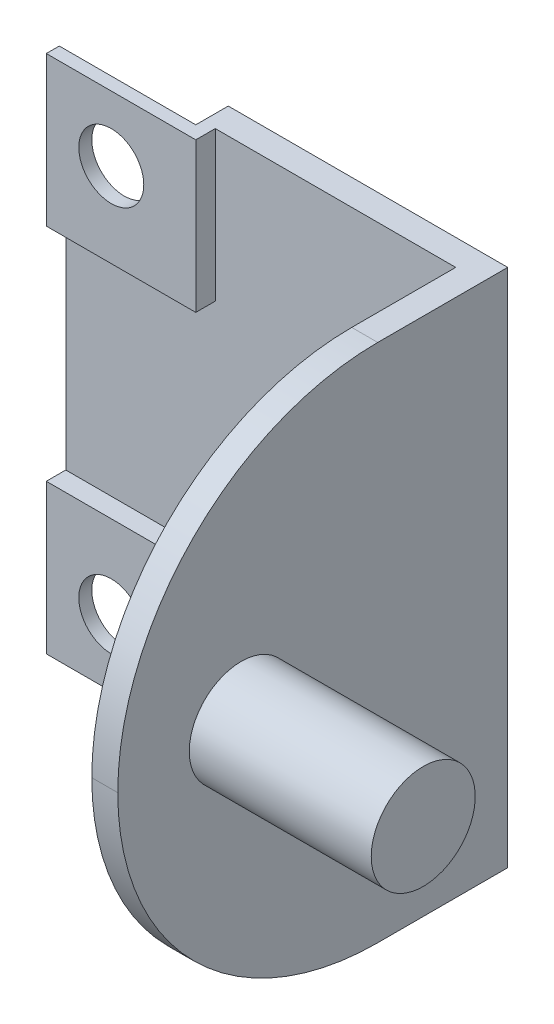
ISO-10303-21;
HEADER;
FILE_DESCRIPTION(('STEP AP214'),'2;1');
FILE_NAME('part.step','',(''),(''),'','','');
FILE_SCHEMA(('AUTOMOTIVE_DESIGN { 1 0 10303 214 1 1 1 1 }'));
ENDSEC;
DATA;
#1=APPLICATION_CONTEXT('core data for automotive mechanical design processes');
#2=APPLICATION_PROTOCOL_DEFINITION('international standard','automotive_design',2000,#1);
#3=PRODUCT_CONTEXT('',#1,'mechanical');
#4=PRODUCT('Part','Part','',(#3));
#5=PRODUCT_RELATED_PRODUCT_CATEGORY('part','',(#4));
#6=PRODUCT_DEFINITION_FORMATION('','',#4);
#7=PRODUCT_DEFINITION_CONTEXT('part definition',#1,'design');
#8=PRODUCT_DEFINITION('design','',#6,#7);
#9=PRODUCT_DEFINITION_SHAPE('','',#8);
#10=(LENGTH_UNIT() NAMED_UNIT(*) SI_UNIT(.MILLI.,.METRE.));
#11=(NAMED_UNIT(*) PLANE_ANGLE_UNIT() SI_UNIT($,.RADIAN.));
#12=(NAMED_UNIT(*) SI_UNIT($,.STERADIAN.) SOLID_ANGLE_UNIT());
#13=UNCERTAINTY_MEASURE_WITH_UNIT(LENGTH_MEASURE(1.E-05),#10,'distance_accuracy_value','');
#14=(GEOMETRIC_REPRESENTATION_CONTEXT(3) GLOBAL_UNCERTAINTY_ASSIGNED_CONTEXT((#13)) GLOBAL_UNIT_ASSIGNED_CONTEXT((#10,
#11,#12)) REPRESENTATION_CONTEXT('',''));
#15=CARTESIAN_POINT('',(0.,0.,0.));
#16=DIRECTION('',(0.,0.,1.));
#17=DIRECTION('',(1.,0.,0.));
#18=AXIS2_PLACEMENT_3D('',#15,#16,#17);
#19=CARTESIAN_POINT('',(-32.,10.5,-28.));
#20=DIRECTION('',(0.,1.,0.));
#21=DIRECTION('',(-1.,0.,0.));
#22=AXIS2_PLACEMENT_3D('',#19,#20,#21);
#23=PLANE('',#22);
#24=DIRECTION('',(1.,0.,0.));
#25=VECTOR('',#24,1.);
#26=CARTESIAN_POINT('',(-32.,10.5,2.5));
#27=LINE('',#26,#25);
#28=CARTESIAN_POINT('',(-32.,10.5,2.5));
#29=VERTEX_POINT('',#28);
#30=CARTESIAN_POINT('',(-21.5,10.5,2.5));
#31=VERTEX_POINT('',#30);
#32=EDGE_CURVE('E179',#29,#31,#27,.T.);
#33=ORIENTED_EDGE('',*,*,#32,.F.);
#34=DIRECTION('',(0.,0.,1.));
#35=VECTOR('',#34,1.);
#36=CARTESIAN_POINT('',(-32.,10.5,-28.));
#37=LINE('',#36,#35);
#38=CARTESIAN_POINT('',(-32.,10.5,0.));
#39=VERTEX_POINT('',#38);
#40=EDGE_CURVE('E191',#39,#29,#37,.T.);
#41=ORIENTED_EDGE('',*,*,#40,.F.);
#42=DIRECTION('',(-1.,0.,0.));
#43=VECTOR('',#42,1.);
#44=CARTESIAN_POINT('',(0.,10.5,0.));
#45=LINE('',#44,#43);
#46=CARTESIAN_POINT('',(-21.5,10.5,0.));
#47=VERTEX_POINT('',#46);
#48=EDGE_CURVE('E291',#47,#39,#45,.T.);
#49=ORIENTED_EDGE('',*,*,#48,.F.);
#50=DIRECTION('',(0.,0.,1.));
#51=VECTOR('',#50,1.);
#52=CARTESIAN_POINT('',(-21.5,10.5,-28.));
#53=LINE('',#52,#51);
#54=EDGE_CURVE('E67',#47,#31,#53,.T.);
#55=ORIENTED_EDGE('',*,*,#54,.T.);
#56=EDGE_LOOP('',(#33,#41,#49,#55));
#57=FACE_BOUND('',#56,.T.);
#58=ADVANCED_FACE('F41',(#57),#23,.F.);
#59=CARTESIAN_POINT('',(-21.5,0.,-28.));
#60=DIRECTION('',(1.,0.,0.));
#61=DIRECTION('',(0.,1.,0.));
#62=AXIS2_PLACEMENT_3D('',#59,#60,#61);
#63=PLANE('',#62);
#64=DIRECTION('',(0.,-1.,0.));
#65=VECTOR('',#64,1.);
#66=CARTESIAN_POINT('',(-21.5,0.,2.50000000000001));
#67=LINE('',#66,#65);
#68=CARTESIAN_POINT('',(-21.5,0.,2.50000000000001));
#69=VERTEX_POINT('',#68);
#70=EDGE_CURVE('E188',#31,#69,#67,.T.);
#71=ORIENTED_EDGE('',*,*,#70,.F.);
#72=ORIENTED_EDGE('',*,*,#54,.F.);
#73=DIRECTION('',(0.,1.,0.));
#74=VECTOR('',#73,1.);
#75=CARTESIAN_POINT('',(-21.5,0.,0.));
#76=LINE('',#75,#74);
#77=CARTESIAN_POINT('',(-21.5,0.,0.));
#78=VERTEX_POINT('',#77);
#79=EDGE_CURVE('E284',#78,#47,#76,.T.);
#80=ORIENTED_EDGE('',*,*,#79,.F.);
#81=DIRECTION('',(0.,0.,1.));
#82=VECTOR('',#81,1.);
#83=CARTESIAN_POINT('',(-21.5,0.,-28.));
#84=LINE('',#83,#82);
#85=EDGE_CURVE('E209',#78,#69,#84,.T.);
#86=ORIENTED_EDGE('',*,*,#85,.T.);
#87=EDGE_LOOP('',(#71,#72,#80,#86));
#88=FACE_BOUND('',#87,.T.);
#89=ADVANCED_FACE('F476',(#88),#63,.F.);
#90=CARTESIAN_POINT('',(-21.5,40.,-28.));
#91=DIRECTION('',(1.,0.,0.));
#92=DIRECTION('',(0.,0.,-1.));
#93=AXIS2_PLACEMENT_3D('',#90,#91,#92);
#94=PLANE('',#93);
#95=DIRECTION('',(0.,-1.,0.));
#96=VECTOR('',#95,1.);
#97=CARTESIAN_POINT('',(-21.5,40.,2.5));
#98=LINE('',#97,#96);
#99=CARTESIAN_POINT('',(-21.5,40.,2.5));
#100=VERTEX_POINT('',#99);
#101=CARTESIAN_POINT('',(-21.5,29.5,2.5));
#102=VERTEX_POINT('',#101);
#103=EDGE_CURVE('E194',#100,#102,#98,.T.);
#104=ORIENTED_EDGE('',*,*,#103,.F.);
#105=DIRECTION('',(0.,0.,1.));
#106=VECTOR('',#105,1.);
#107=CARTESIAN_POINT('',(-21.5,40.,-28.));
#108=LINE('',#107,#106);
#109=CARTESIAN_POINT('',(-21.5,40.,0.));
#110=VERTEX_POINT('',#109);
#111=EDGE_CURVE('E222',#110,#100,#108,.T.);
#112=ORIENTED_EDGE('',*,*,#111,.F.);
#113=DIRECTION('',(0.,1.,0.));
#114=VECTOR('',#113,1.);
#115=CARTESIAN_POINT('',(-21.5,0.,0.));
#116=LINE('',#115,#114);
#117=CARTESIAN_POINT('',(-21.5,29.5,0.));
#118=VERTEX_POINT('',#117);
#119=EDGE_CURVE('E11',#118,#110,#116,.T.);
#120=ORIENTED_EDGE('',*,*,#119,.F.);
#121=DIRECTION('',(0.,0.,1.));
#122=VECTOR('',#121,1.);
#123=CARTESIAN_POINT('',(-21.5,29.5,-28.));
#124=LINE('',#123,#122);
#125=EDGE_CURVE('E59',#118,#102,#124,.T.);
#126=ORIENTED_EDGE('',*,*,#125,.T.);
#127=EDGE_LOOP('',(#104,#112,#120,#126));
#128=FACE_BOUND('',#127,.T.);
#129=ADVANCED_FACE('F401',(#128),#94,.F.);
#130=CARTESIAN_POINT('',(-32.,29.5,-28.));
#131=DIRECTION('',(0.,-1.,0.));
#132=DIRECTION('',(0.,0.,-1.));
#133=AXIS2_PLACEMENT_3D('',#130,#131,#132);
#134=PLANE('',#133);
#135=DIRECTION('',(1.,0.,0.));
#136=VECTOR('',#135,1.);
#137=CARTESIAN_POINT('',(-32.,29.5,2.5));
#138=LINE('',#137,#136);
#139=CARTESIAN_POINT('',(-32.,29.5,2.5));
#140=VERTEX_POINT('',#139);
#141=EDGE_CURVE('E328',#140,#102,#138,.T.);
#142=ORIENTED_EDGE('',*,*,#141,.T.);
#143=ORIENTED_EDGE('',*,*,#125,.F.);
#144=DIRECTION('',(1.,0.,0.));
#145=VECTOR('',#144,1.);
#146=CARTESIAN_POINT('',(0.,29.5,0.));
#147=LINE('',#146,#145);
#148=CARTESIAN_POINT('',(-32.,29.5,0.));
#149=VERTEX_POINT('',#148);
#150=EDGE_CURVE('E51',#149,#118,#147,.T.);
#151=ORIENTED_EDGE('',*,*,#150,.F.);
#152=DIRECTION('',(0.,0.,1.));
#153=VECTOR('',#152,1.);
#154=CARTESIAN_POINT('',(-32.,29.5,-28.));
#155=LINE('',#154,#153);
#156=EDGE_CURVE('E203',#149,#140,#155,.T.);
#157=ORIENTED_EDGE('',*,*,#156,.T.);
#158=EDGE_LOOP('',(#142,#143,#151,#157));
#159=FACE_BOUND('',#158,.T.);
#160=ADVANCED_FACE('F405',(#159),#134,.F.);
#161=CARTESIAN_POINT('',(0.,0.,2.));
#162=DIRECTION('',(-1.,0.,0.));
#163=DIRECTION('',(0.,-1.,0.));
#164=AXIS2_PLACEMENT_3D('',#161,#162,#163);
#165=PLANE('',#164);
#166=CARTESIAN_POINT('',(0.,20.,20.5));
#167=DIRECTION('',(1.,0.,0.));
#168=DIRECTION('',(0.,1.,0.));
#169=AXIS2_PLACEMENT_3D('',#166,#167,#168);
#170=CIRCLE('',#169,4.);
#171=CARTESIAN_POINT('',(0.,24.,20.5));
#172=VERTEX_POINT('',#171);
#173=EDGE_CURVE('E217',#172,#172,#170,.T.);
#174=ORIENTED_EDGE('',*,*,#173,.F.);
#175=EDGE_LOOP('',(#174));
#176=FACE_BOUND('',#175,.T.);
#177=DIRECTION('',(0.,0.,-1.));
#178=VECTOR('',#177,1.);
#179=CARTESIAN_POINT('',(0.,40.,2.));
#180=LINE('',#179,#178);
#181=CARTESIAN_POINT('',(0.,40.,10.));
#182=VERTEX_POINT('',#181);
#183=CARTESIAN_POINT('',(0.,40.,0.));
#184=VERTEX_POINT('',#183);
#185=EDGE_CURVE('E262',#182,#184,#180,.T.);
#186=ORIENTED_EDGE('',*,*,#185,.F.);
#187=CARTESIAN_POINT('',(0.,20.,10.));
#188=DIRECTION('',(-1.,0.,0.));
#189=DIRECTION('',(0.,-1.,0.));
#190=AXIS2_PLACEMENT_3D('',#187,#188,#189);
#191=CIRCLE('',#190,20.);
#192=CARTESIAN_POINT('',(0.,20.,30.));
#193=VERTEX_POINT('',#192);
#194=EDGE_CURVE('E278',#182,#193,#191,.F.);
#195=ORIENTED_EDGE('',*,*,#194,.T.);
#196=CARTESIAN_POINT('',(0.,20.,10.));
#197=DIRECTION('',(-1.,0.,0.));
#198=DIRECTION('',(0.,-1.,0.));
#199=AXIS2_PLACEMENT_3D('',#196,#197,#198);
#200=CIRCLE('',#199,20.);
#201=CARTESIAN_POINT('',(0.,0.,10.));
#202=VERTEX_POINT('',#201);
#203=EDGE_CURVE('E275',#193,#202,#200,.F.);
#204=ORIENTED_EDGE('',*,*,#203,.T.);
#205=DIRECTION('',(0.,0.,-1.));
#206=VECTOR('',#205,1.);
#207=CARTESIAN_POINT('',(0.,0.,2.));
#208=LINE('',#207,#206);
#209=CARTESIAN_POINT('',(0.,0.,0.));
#210=VERTEX_POINT('',#209);
#211=EDGE_CURVE('E247',#202,#210,#208,.T.);
#212=ORIENTED_EDGE('',*,*,#211,.T.);
#213=DIRECTION('',(0.,1.,0.));
#214=VECTOR('',#213,1.);
#215=CARTESIAN_POINT('',(0.,0.,0.));
#216=LINE('',#215,#214);
#217=EDGE_CURVE('E234',#210,#184,#216,.T.);
#218=ORIENTED_EDGE('',*,*,#217,.T.);
#219=EDGE_LOOP('',(#186,#195,#204,#212,#218));
#220=FACE_BOUND('',#219,.T.);
#221=ADVANCED_FACE('F419',(#176,#220),#165,.F.);
#222=CARTESIAN_POINT('',(0.,40.,2.));
#223=DIRECTION('',(0.,-1.,0.));
#224=DIRECTION('',(1.,0.,0.));
#225=AXIS2_PLACEMENT_3D('',#222,#223,#224);
#226=PLANE('',#225);
#227=DIRECTION('',(-1.,0.,0.));
#228=VECTOR('',#227,1.);
#229=CARTESIAN_POINT('',(0.,40.,0.));
#230=LINE('',#229,#228);
#231=EDGE_CURVE('E251',#184,#110,#230,.T.);
#232=ORIENTED_EDGE('',*,*,#231,.T.);
#233=ORIENTED_EDGE('',*,*,#111,.T.);
#234=DIRECTION('',(1.,0.,0.));
#235=VECTOR('',#234,1.);
#236=CARTESIAN_POINT('',(-32.,40.,2.5));
#237=LINE('',#236,#235);
#238=CARTESIAN_POINT('',(-32.,40.,2.5));
#239=VERTEX_POINT('',#238);
#240=EDGE_CURVE('E333',#239,#100,#237,.T.);
#241=ORIENTED_EDGE('',*,*,#240,.F.);
#242=DIRECTION('',(0.,0.,-1.));
#243=VECTOR('',#242,1.);
#244=CARTESIAN_POINT('',(-32.,40.,3.5));
#245=LINE('',#244,#243);
#246=CARTESIAN_POINT('',(-32.,40.,3.5));
#247=VERTEX_POINT('',#246);
#248=EDGE_CURVE('E322',#247,#239,#245,.T.);
#249=ORIENTED_EDGE('',*,*,#248,.F.);
#250=DIRECTION('',(-1.,0.,0.));
#251=VECTOR('',#250,1.);
#252=CARTESIAN_POINT('',(0.,40.,3.5));
#253=LINE('',#252,#251);
#254=CARTESIAN_POINT('',(-20.5,40.,3.5));
#255=VERTEX_POINT('',#254);
#256=EDGE_CURVE('E371',#255,#247,#253,.T.);
#257=ORIENTED_EDGE('',*,*,#256,.F.);
#258=DIRECTION('',(0.,0.,-1.));
#259=VECTOR('',#258,1.);
#260=CARTESIAN_POINT('',(-20.5,40.,3.5));
#261=LINE('',#260,#259);
#262=CARTESIAN_POINT('',(-20.5,40.,2.));
#263=VERTEX_POINT('',#262);
#264=EDGE_CURVE('E216',#255,#263,#261,.T.);
#265=ORIENTED_EDGE('',*,*,#264,.T.);
#266=DIRECTION('',(-1.,0.,0.));
#267=VECTOR('',#266,1.);
#268=CARTESIAN_POINT('',(0.,40.,2.));
#269=LINE('',#268,#267);
#270=CARTESIAN_POINT('',(-2.,40.,2.));
#271=VERTEX_POINT('',#270);
#272=EDGE_CURVE('E235',#271,#263,#269,.T.);
#273=ORIENTED_EDGE('',*,*,#272,.F.);
#274=DIRECTION('',(0.,0.,-1.));
#275=VECTOR('',#274,1.);
#276=CARTESIAN_POINT('',(-2.,40.,30.));
#277=LINE('',#276,#275);
#278=CARTESIAN_POINT('',(-2.,40.,10.));
#279=VERTEX_POINT('',#278);
#280=EDGE_CURVE('E231',#279,#271,#277,.T.);
#281=ORIENTED_EDGE('',*,*,#280,.F.);
#282=DIRECTION('',(-1.,0.,0.));
#283=VECTOR('',#282,1.);
#284=CARTESIAN_POINT('',(0.,40.,10.));
#285=LINE('',#284,#283);
#286=EDGE_CURVE('E271',#279,#182,#285,.F.);
#287=ORIENTED_EDGE('',*,*,#286,.T.);
#288=ORIENTED_EDGE('',*,*,#185,.T.);
#289=EDGE_LOOP('',(#232,#233,#241,#249,#257,#265,#273,#281,#287,#288));
#290=FACE_BOUND('',#289,.T.);
#291=ADVANCED_FACE('F413',(#290),#226,.F.);
#292=CARTESIAN_POINT('',(-32.,0.,2.));
#293=DIRECTION('',(1.,0.,0.));
#294=DIRECTION('',(0.,0.,-1.));
#295=AXIS2_PLACEMENT_3D('',#292,#293,#294);
#296=PLANE('',#295);
#297=DIRECTION('',(0.,-1.,0.));
#298=VECTOR('',#297,1.);
#299=CARTESIAN_POINT('',(-32.,0.,2.));
#300=LINE('',#299,#298);
#301=CARTESIAN_POINT('',(-32.,28.5,2.));
#302=VERTEX_POINT('',#301);
#303=CARTESIAN_POINT('',(-32.,11.5,2.));
#304=VERTEX_POINT('',#303);
#305=EDGE_CURVE('E239',#302,#304,#300,.T.);
#306=ORIENTED_EDGE('',*,*,#305,.F.);
#307=DIRECTION('',(0.,0.,-1.));
#308=VECTOR('',#307,1.);
#309=CARTESIAN_POINT('',(-32.,28.5,3.5));
#310=LINE('',#309,#308);
#311=CARTESIAN_POINT('',(-32.,28.5,3.5));
#312=VERTEX_POINT('',#311);
#313=EDGE_CURVE('E391',#312,#302,#310,.T.);
#314=ORIENTED_EDGE('',*,*,#313,.F.);
#315=DIRECTION('',(0.,-1.,0.));
#316=VECTOR('',#315,1.);
#317=CARTESIAN_POINT('',(-32.,0.,3.5));
#318=LINE('',#317,#316);
#319=EDGE_CURVE('E376',#247,#312,#318,.T.);
#320=ORIENTED_EDGE('',*,*,#319,.F.);
#321=ORIENTED_EDGE('',*,*,#248,.T.);
#322=DIRECTION('',(0.,-1.,0.));
#323=VECTOR('',#322,1.);
#324=CARTESIAN_POINT('',(-32.,40.,2.5));
#325=LINE('',#324,#323);
#326=EDGE_CURVE('E325',#239,#140,#325,.T.);
#327=ORIENTED_EDGE('',*,*,#326,.T.);
#328=ORIENTED_EDGE('',*,*,#156,.F.);
#329=DIRECTION('',(0.,-1.,0.));
#330=VECTOR('',#329,1.);
#331=CARTESIAN_POINT('',(-32.,0.,0.));
#332=LINE('',#331,#330);
#333=EDGE_CURVE('E201',#149,#39,#332,.T.);
#334=ORIENTED_EDGE('',*,*,#333,.T.);
#335=ORIENTED_EDGE('',*,*,#40,.T.);
#336=DIRECTION('',(0.,-1.,0.));
#337=VECTOR('',#336,1.);
#338=CARTESIAN_POINT('',(-32.,0.,2.50000000000001));
#339=LINE('',#338,#337);
#340=CARTESIAN_POINT('',(-32.,0.,2.50000000000001));
#341=VERTEX_POINT('',#340);
#342=EDGE_CURVE('E176',#29,#341,#339,.T.);
#343=ORIENTED_EDGE('',*,*,#342,.T.);
#344=DIRECTION('',(0.,0.,1.));
#345=VECTOR('',#344,1.);
#346=CARTESIAN_POINT('',(-32.,0.,3.50000000000001));
#347=LINE('',#346,#345);
#348=CARTESIAN_POINT('',(-32.,0.,3.50000000000001));
#349=VERTEX_POINT('',#348);
#350=EDGE_CURVE('E187',#341,#349,#347,.T.);
#351=ORIENTED_EDGE('',*,*,#350,.T.);
#352=DIRECTION('',(0.,-1.,0.));
#353=VECTOR('',#352,1.);
#354=CARTESIAN_POINT('',(-32.,0.,3.5));
#355=LINE('',#354,#353);
#356=CARTESIAN_POINT('',(-32.,11.5,3.5));
#357=VERTEX_POINT('',#356);
#358=EDGE_CURVE('E341',#357,#349,#355,.T.);
#359=ORIENTED_EDGE('',*,*,#358,.F.);
#360=DIRECTION('',(0.,0.,-1.));
#361=VECTOR('',#360,1.);
#362=CARTESIAN_POINT('',(-32.,11.5,3.5));
#363=LINE('',#362,#361);
#364=EDGE_CURVE('E363',#357,#304,#363,.T.);
#365=ORIENTED_EDGE('',*,*,#364,.T.);
#366=EDGE_LOOP('',(#306,#314,#320,#321,#327,#328,#334,#335,#343,#351,#359,#365));
#367=FACE_BOUND('',#366,.T.);
#368=ADVANCED_FACE('F198',(#367),#296,.F.);
#369=CARTESIAN_POINT('',(0.,0.,2.));
#370=DIRECTION('',(0.,1.,0.));
#371=DIRECTION('',(-1.,0.,0.));
#372=AXIS2_PLACEMENT_3D('',#369,#370,#371);
#373=PLANE('',#372);
#374=DIRECTION('',(1.,0.,0.));
#375=VECTOR('',#374,1.);
#376=CARTESIAN_POINT('',(0.,0.,2.));
#377=LINE('',#376,#375);
#378=CARTESIAN_POINT('',(-20.5,0.,2.));
#379=VERTEX_POINT('',#378);
#380=CARTESIAN_POINT('',(-2.,0.,2.));
#381=VERTEX_POINT('',#380);
#382=EDGE_CURVE('E244',#379,#381,#377,.T.);
#383=ORIENTED_EDGE('',*,*,#382,.F.);
#384=DIRECTION('',(0.,0.,-1.));
#385=VECTOR('',#384,1.);
#386=CARTESIAN_POINT('',(-20.5,0.,3.5));
#387=LINE('',#386,#385);
#388=CARTESIAN_POINT('',(-20.5,0.,3.5));
#389=VERTEX_POINT('',#388);
#390=EDGE_CURVE('E360',#389,#379,#387,.T.);
#391=ORIENTED_EDGE('',*,*,#390,.F.);
#392=DIRECTION('',(1.,0.,0.));
#393=VECTOR('',#392,1.);
#394=CARTESIAN_POINT('',(0.,0.,3.5));
#395=LINE('',#394,#393);
#396=EDGE_CURVE('E345',#349,#389,#395,.T.);
#397=ORIENTED_EDGE('',*,*,#396,.F.);
#398=ORIENTED_EDGE('',*,*,#350,.F.);
#399=DIRECTION('',(1.,0.,0.));
#400=VECTOR('',#399,1.);
#401=CARTESIAN_POINT('',(-32.,0.,2.50000000000001));
#402=LINE('',#401,#400);
#403=EDGE_CURVE('E181',#341,#69,#402,.T.);
#404=ORIENTED_EDGE('',*,*,#403,.T.);
#405=ORIENTED_EDGE('',*,*,#85,.F.);
#406=DIRECTION('',(1.,0.,0.));
#407=VECTOR('',#406,1.);
#408=CARTESIAN_POINT('',(0.,0.,0.));
#409=LINE('',#408,#407);
#410=EDGE_CURVE('E240',#78,#210,#409,.T.);
#411=ORIENTED_EDGE('',*,*,#410,.T.);
#412=ORIENTED_EDGE('',*,*,#211,.F.);
#413=DIRECTION('',(1.,0.,0.));
#414=VECTOR('',#413,1.);
#415=CARTESIAN_POINT('',(-2.,0.,10.));
#416=LINE('',#415,#414);
#417=CARTESIAN_POINT('',(-2.,0.,10.));
#418=VERTEX_POINT('',#417);
#419=EDGE_CURVE('E281',#202,#418,#416,.F.);
#420=ORIENTED_EDGE('',*,*,#419,.T.);
#421=DIRECTION('',(0.,0.,-1.));
#422=VECTOR('',#421,1.);
#423=CARTESIAN_POINT('',(-2.,0.,30.));
#424=LINE('',#423,#422);
#425=EDGE_CURVE('E227',#418,#381,#424,.T.);
#426=ORIENTED_EDGE('',*,*,#425,.T.);
#427=EDGE_LOOP('',(#383,#391,#397,#398,#404,#405,#411,#412,#420,#426));
#428=FACE_BOUND('',#427,.T.);
#429=ADVANCED_FACE('F425',(#428),#373,.F.);
#430=CARTESIAN_POINT('',(0.,0.,2.));
#431=DIRECTION('',(0.,0.,1.));
#432=DIRECTION('',(1.,0.,0.));
#433=AXIS2_PLACEMENT_3D('',#430,#431,#432);
#434=PLANE('',#433);
#435=DIRECTION('',(1.,0.,0.));
#436=VECTOR('',#435,1.);
#437=CARTESIAN_POINT('',(0.,11.5,2.));
#438=LINE('',#437,#436);
#439=CARTESIAN_POINT('',(-20.5,11.5,2.));
#440=VERTEX_POINT('',#439);
#441=EDGE_CURVE('E336',#304,#440,#438,.T.);
#442=ORIENTED_EDGE('',*,*,#441,.T.);
#443=DIRECTION('',(0.,1.,0.));
#444=VECTOR('',#443,1.);
#445=CARTESIAN_POINT('',(-20.5,0.,2.));
#446=LINE('',#445,#444);
#447=EDGE_CURVE('E342',#379,#440,#446,.T.);
#448=ORIENTED_EDGE('',*,*,#447,.F.);
#449=ORIENTED_EDGE('',*,*,#382,.T.);
#450=DIRECTION('',(0.,-1.,0.));
#451=VECTOR('',#450,1.);
#452=CARTESIAN_POINT('',(-2.,0.,2.));
#453=LINE('',#452,#451);
#454=EDGE_CURVE('E223',#271,#381,#453,.T.);
#455=ORIENTED_EDGE('',*,*,#454,.F.);
#456=ORIENTED_EDGE('',*,*,#272,.T.);
#457=DIRECTION('',(0.,-1.,0.));
#458=VECTOR('',#457,1.);
#459=CARTESIAN_POINT('',(-20.5,0.,2.));
#460=LINE('',#459,#458);
#461=CARTESIAN_POINT('',(-20.5,28.5,2.));
#462=VERTEX_POINT('',#461);
#463=EDGE_CURVE('E366',#263,#462,#460,.T.);
#464=ORIENTED_EDGE('',*,*,#463,.T.);
#465=DIRECTION('',(1.,0.,0.));
#466=VECTOR('',#465,1.);
#467=CARTESIAN_POINT('',(0.,28.5,2.));
#468=LINE('',#467,#466);
#469=EDGE_CURVE('E372',#302,#462,#468,.T.);
#470=ORIENTED_EDGE('',*,*,#469,.F.);
#471=ORIENTED_EDGE('',*,*,#305,.T.);
#472=EDGE_LOOP('',(#442,#448,#449,#455,#456,#464,#470,#471));
#473=FACE_BOUND('',#472,.T.);
#474=ADVANCED_FACE('F441',(#473),#434,.T.);
#475=CARTESIAN_POINT('',(0.,0.,0.));
#476=DIRECTION('',(0.,0.,1.));
#477=DIRECTION('',(1.,0.,0.));
#478=AXIS2_PLACEMENT_3D('',#475,#476,#477);
#479=PLANE('',#478);
#480=ORIENTED_EDGE('',*,*,#150,.T.);
#481=ORIENTED_EDGE('',*,*,#119,.T.);
#482=ORIENTED_EDGE('',*,*,#231,.F.);
#483=ORIENTED_EDGE('',*,*,#217,.F.);
#484=ORIENTED_EDGE('',*,*,#410,.F.);
#485=ORIENTED_EDGE('',*,*,#79,.T.);
#486=ORIENTED_EDGE('',*,*,#48,.T.);
#487=ORIENTED_EDGE('',*,*,#333,.F.);
#488=EDGE_LOOP('',(#480,#481,#482,#483,#484,#485,#486,#487));
#489=FACE_BOUND('',#488,.T.);
#490=ADVANCED_FACE('F404',(#489),#479,.F.);
#491=CARTESIAN_POINT('',(-2.,0.,30.));
#492=DIRECTION('',(1.,0.,0.));
#493=DIRECTION('',(0.,0.,-1.));
#494=AXIS2_PLACEMENT_3D('',#491,#492,#493);
#495=PLANE('',#494);
#496=CARTESIAN_POINT('',(-2.,20.,10.));
#497=DIRECTION('',(1.,0.,0.));
#498=DIRECTION('',(0.,0.,-1.));
#499=AXIS2_PLACEMENT_3D('',#496,#497,#498);
#500=CIRCLE('',#499,20.);
#501=CARTESIAN_POINT('',(-2.,20.,30.));
#502=VERTEX_POINT('',#501);
#503=EDGE_CURVE('E265',#418,#502,#500,.F.);
#504=ORIENTED_EDGE('',*,*,#503,.T.);
#505=CARTESIAN_POINT('',(-2.,20.,10.));
#506=DIRECTION('',(1.,0.,0.));
#507=DIRECTION('',(0.,0.,-1.));
#508=AXIS2_PLACEMENT_3D('',#505,#506,#507);
#509=CIRCLE('',#508,20.);
#510=EDGE_CURVE('E268',#502,#279,#509,.F.);
#511=ORIENTED_EDGE('',*,*,#510,.T.);
#512=ORIENTED_EDGE('',*,*,#280,.T.);
#513=ORIENTED_EDGE('',*,*,#454,.T.);
#514=ORIENTED_EDGE('',*,*,#425,.F.);
#515=EDGE_LOOP('',(#504,#511,#512,#513,#514));
#516=FACE_BOUND('',#515,.T.);
#517=ADVANCED_FACE('F433',(#516),#495,.F.);
#518=CARTESIAN_POINT('',(0.,20.,10.));
#519=DIRECTION('',(-1.,0.,0.));
#520=DIRECTION('',(0.,-1.,0.));
#521=AXIS2_PLACEMENT_3D('',#518,#519,#520);
#522=CYLINDRICAL_SURFACE('',#521,20.);
#523=ORIENTED_EDGE('',*,*,#419,.F.);
#524=ORIENTED_EDGE('',*,*,#203,.F.);
#525=DIRECTION('',(1.,0.,0.));
#526=VECTOR('',#525,1.);
#527=CARTESIAN_POINT('',(0.,20.,30.));
#528=LINE('',#527,#526);
#529=EDGE_CURVE('E221',#502,#193,#528,.T.);
#530=ORIENTED_EDGE('',*,*,#529,.F.);
#531=ORIENTED_EDGE('',*,*,#503,.F.);
#532=EDGE_LOOP('',(#523,#524,#530,#531));
#533=FACE_BOUND('',#532,.T.);
#534=ADVANCED_FACE('F43',(#533),#522,.T.);
#535=CARTESIAN_POINT('',(0.,20.,10.));
#536=DIRECTION('',(1.,0.,0.));
#537=DIRECTION('',(0.,1.,0.));
#538=AXIS2_PLACEMENT_3D('',#535,#536,#537);
#539=CYLINDRICAL_SURFACE('',#538,20.);
#540=ORIENTED_EDGE('',*,*,#194,.F.);
#541=ORIENTED_EDGE('',*,*,#286,.F.);
#542=ORIENTED_EDGE('',*,*,#510,.F.);
#543=ORIENTED_EDGE('',*,*,#529,.T.);
#544=EDGE_LOOP('',(#540,#541,#542,#543));
#545=FACE_BOUND('',#544,.T.);
#546=ADVANCED_FACE('F466',(#545),#539,.T.);
#547=CARTESIAN_POINT('',(-20.5,0.,3.5));
#548=DIRECTION('',(1.,0.,0.));
#549=DIRECTION('',(0.,0.,-1.));
#550=AXIS2_PLACEMENT_3D('',#547,#548,#549);
#551=PLANE('',#550);
#552=ORIENTED_EDGE('',*,*,#463,.F.);
#553=ORIENTED_EDGE('',*,*,#264,.F.);
#554=DIRECTION('',(0.,-1.,0.));
#555=VECTOR('',#554,1.);
#556=CARTESIAN_POINT('',(-20.5,0.,3.5));
#557=LINE('',#556,#555);
#558=CARTESIAN_POINT('',(-20.5,28.5,3.5));
#559=VERTEX_POINT('',#558);
#560=EDGE_CURVE('E367',#255,#559,#557,.T.);
#561=ORIENTED_EDGE('',*,*,#560,.T.);
#562=DIRECTION('',(0.,0.,-1.));
#563=VECTOR('',#562,1.);
#564=CARTESIAN_POINT('',(-20.5,28.5,3.5));
#565=LINE('',#564,#563);
#566=EDGE_CURVE('E382',#559,#462,#565,.T.);
#567=ORIENTED_EDGE('',*,*,#566,.T.);
#568=EDGE_LOOP('',(#552,#553,#561,#567));
#569=FACE_BOUND('',#568,.T.);
#570=ADVANCED_FACE('F464',(#569),#551,.T.);
#571=CARTESIAN_POINT('',(0.,28.5,3.5));
#572=DIRECTION('',(0.,1.,0.));
#573=DIRECTION('',(0.,0.,1.));
#574=AXIS2_PLACEMENT_3D('',#571,#572,#573);
#575=PLANE('',#574);
#576=ORIENTED_EDGE('',*,*,#469,.T.);
#577=ORIENTED_EDGE('',*,*,#566,.F.);
#578=DIRECTION('',(1.,0.,0.));
#579=VECTOR('',#578,1.);
#580=CARTESIAN_POINT('',(0.,28.5,3.5));
#581=LINE('',#580,#579);
#582=EDGE_CURVE('E379',#312,#559,#581,.T.);
#583=ORIENTED_EDGE('',*,*,#582,.F.);
#584=ORIENTED_EDGE('',*,*,#313,.T.);
#585=EDGE_LOOP('',(#576,#577,#583,#584));
#586=FACE_BOUND('',#585,.T.);
#587=ADVANCED_FACE('F458',(#586),#575,.F.);
#588=CARTESIAN_POINT('',(0.,0.,3.5));
#589=DIRECTION('',(0.,0.,1.));
#590=DIRECTION('',(1.,0.,0.));
#591=AXIS2_PLACEMENT_3D('',#588,#589,#590);
#592=PLANE('',#591);
#593=CARTESIAN_POINT('',(-27.,35.,3.5));
#594=DIRECTION('',(0.,0.,1.));
#595=DIRECTION('',(1.,0.,0.));
#596=AXIS2_PLACEMENT_3D('',#593,#594,#595);
#597=CIRCLE('',#596,2.5);
#598=CARTESIAN_POINT('',(-24.5,35.,3.5));
#599=VERTEX_POINT('',#598);
#600=EDGE_CURVE('E299',#599,#599,#597,.T.);
#601=ORIENTED_EDGE('',*,*,#600,.F.);
#602=EDGE_LOOP('',(#601));
#603=FACE_BOUND('',#602,.T.);
#604=ORIENTED_EDGE('',*,*,#256,.T.);
#605=ORIENTED_EDGE('',*,*,#319,.T.);
#606=ORIENTED_EDGE('',*,*,#582,.T.);
#607=ORIENTED_EDGE('',*,*,#560,.F.);
#608=EDGE_LOOP('',(#604,#605,#606,#607));
#609=FACE_BOUND('',#608,.T.);
#610=ADVANCED_FACE('F462',(#603,#609),#592,.T.);
#611=CARTESIAN_POINT('',(0.,11.5,3.5));
#612=DIRECTION('',(0.,1.,0.));
#613=DIRECTION('',(0.,0.,1.));
#614=AXIS2_PLACEMENT_3D('',#611,#612,#613);
#615=PLANE('',#614);
#616=ORIENTED_EDGE('',*,*,#441,.F.);
#617=ORIENTED_EDGE('',*,*,#364,.F.);
#618=DIRECTION('',(1.,0.,0.));
#619=VECTOR('',#618,1.);
#620=CARTESIAN_POINT('',(0.,11.5,3.5));
#621=LINE('',#620,#619);
#622=CARTESIAN_POINT('',(-20.5,11.5,3.5));
#623=VERTEX_POINT('',#622);
#624=EDGE_CURVE('E337',#357,#623,#621,.T.);
#625=ORIENTED_EDGE('',*,*,#624,.T.);
#626=DIRECTION('',(0.,0.,-1.));
#627=VECTOR('',#626,1.);
#628=CARTESIAN_POINT('',(-20.5,11.5,3.5));
#629=LINE('',#628,#627);
#630=EDGE_CURVE('E351',#623,#440,#629,.T.);
#631=ORIENTED_EDGE('',*,*,#630,.T.);
#632=EDGE_LOOP('',(#616,#617,#625,#631));
#633=FACE_BOUND('',#632,.T.);
#634=ADVANCED_FACE('F453',(#633),#615,.T.);
#635=CARTESIAN_POINT('',(-20.5,0.,3.5));
#636=DIRECTION('',(-1.,0.,0.));
#637=DIRECTION('',(0.,-1.,0.));
#638=AXIS2_PLACEMENT_3D('',#635,#636,#637);
#639=PLANE('',#638);
#640=ORIENTED_EDGE('',*,*,#447,.T.);
#641=ORIENTED_EDGE('',*,*,#630,.F.);
#642=DIRECTION('',(0.,1.,0.));
#643=VECTOR('',#642,1.);
#644=CARTESIAN_POINT('',(-20.5,0.,3.5));
#645=LINE('',#644,#643);
#646=EDGE_CURVE('E348',#389,#623,#645,.T.);
#647=ORIENTED_EDGE('',*,*,#646,.F.);
#648=ORIENTED_EDGE('',*,*,#390,.T.);
#649=EDGE_LOOP('',(#640,#641,#647,#648));
#650=FACE_BOUND('',#649,.T.);
#651=ADVANCED_FACE('F446',(#650),#639,.F.);
#652=CARTESIAN_POINT('',(0.,0.,3.5));
#653=DIRECTION('',(0.,0.,1.));
#654=DIRECTION('',(1.,0.,0.));
#655=AXIS2_PLACEMENT_3D('',#652,#653,#654);
#656=PLANE('',#655);
#657=CARTESIAN_POINT('',(-27.,4.99999999999999,3.5));
#658=DIRECTION('',(0.,0.,1.));
#659=DIRECTION('',(-1.,0.,0.));
#660=AXIS2_PLACEMENT_3D('',#657,#658,#659);
#661=CIRCLE('',#660,2.5);
#662=CARTESIAN_POINT('',(-24.5,4.99999999999999,3.5));
#663=VERTEX_POINT('',#662);
#664=EDGE_CURVE('E306',#663,#663,#661,.T.);
#665=ORIENTED_EDGE('',*,*,#664,.F.);
#666=EDGE_LOOP('',(#665));
#667=FACE_BOUND('',#666,.T.);
#668=ORIENTED_EDGE('',*,*,#624,.F.);
#669=ORIENTED_EDGE('',*,*,#358,.T.);
#670=ORIENTED_EDGE('',*,*,#396,.T.);
#671=ORIENTED_EDGE('',*,*,#646,.T.);
#672=EDGE_LOOP('',(#668,#669,#670,#671));
#673=FACE_BOUND('',#672,.T.);
#674=ADVANCED_FACE('F449',(#667,#673),#656,.T.);
#675=CARTESIAN_POINT('',(-32.,40.,2.5));
#676=DIRECTION('',(0.,0.,1.));
#677=DIRECTION('',(0.,-1.,0.));
#678=AXIS2_PLACEMENT_3D('',#675,#676,#677);
#679=PLANE('',#678);
#680=CARTESIAN_POINT('',(-27.,35.,2.5));
#681=DIRECTION('',(0.,0.,1.));
#682=DIRECTION('',(0.,-1.,0.));
#683=AXIS2_PLACEMENT_3D('',#680,#681,#682);
#684=CIRCLE('',#683,2.5);
#685=CARTESIAN_POINT('',(-24.5,35.,2.5));
#686=VERTEX_POINT('',#685);
#687=EDGE_CURVE('E45',#686,#686,#684,.T.);
#688=ORIENTED_EDGE('',*,*,#687,.T.);
#689=EDGE_LOOP('',(#688));
#690=FACE_BOUND('',#689,.T.);
#691=ORIENTED_EDGE('',*,*,#103,.T.);
#692=ORIENTED_EDGE('',*,*,#141,.F.);
#693=ORIENTED_EDGE('',*,*,#326,.F.);
#694=ORIENTED_EDGE('',*,*,#240,.T.);
#695=EDGE_LOOP('',(#691,#692,#693,#694));
#696=FACE_BOUND('',#695,.T.);
#697=ADVANCED_FACE('F411',(#690,#696),#679,.F.);
#698=CARTESIAN_POINT('',(-32.,0.,2.50000000000001));
#699=DIRECTION('',(0.,0.,1.));
#700=DIRECTION('',(0.,-1.,0.));
#701=AXIS2_PLACEMENT_3D('',#698,#699,#700);
#702=PLANE('',#701);
#703=CARTESIAN_POINT('',(-27.,4.99999999999999,2.5));
#704=DIRECTION('',(0.,0.,1.));
#705=DIRECTION('',(0.,-1.,0.));
#706=AXIS2_PLACEMENT_3D('',#703,#704,#705);
#707=CIRCLE('',#706,2.5);
#708=CARTESIAN_POINT('',(-24.5,4.99999999999999,2.5));
#709=VERTEX_POINT('',#708);
#710=EDGE_CURVE('E296',#709,#709,#707,.T.);
#711=ORIENTED_EDGE('',*,*,#710,.T.);
#712=EDGE_LOOP('',(#711));
#713=FACE_BOUND('',#712,.T.);
#714=ORIENTED_EDGE('',*,*,#70,.T.);
#715=ORIENTED_EDGE('',*,*,#403,.F.);
#716=ORIENTED_EDGE('',*,*,#342,.F.);
#717=ORIENTED_EDGE('',*,*,#32,.T.);
#718=EDGE_LOOP('',(#714,#715,#716,#717));
#719=FACE_BOUND('',#718,.T.);
#720=ADVANCED_FACE('F178',(#713,#719),#702,.F.);
#721=CARTESIAN_POINT('',(-27.,4.99999999999999,-7.));
#722=DIRECTION('',(0.,0.,1.));
#723=DIRECTION('',(1.,0.,0.));
#724=AXIS2_PLACEMENT_3D('',#721,#722,#723);
#725=CYLINDRICAL_SURFACE('',#724,2.5);
#726=CARTESIAN_POINT('',(-24.5,4.99999999999999,3.5));
#727=CARTESIAN_POINT('',(-24.5,4.99999999999999,3.48958333333333));
#728=CARTESIAN_POINT('',(-24.5,4.99999999999999,3.47916666666667));
#729=CARTESIAN_POINT('',(-24.5,4.99999999999999,3.45833333333333));
#730=CARTESIAN_POINT('',(-24.5,4.99999999999999,3.44791666666667));
#731=CARTESIAN_POINT('',(-24.5,4.99999999999999,3.42708333333333));
#732=CARTESIAN_POINT('',(-24.5,4.99999999999999,3.41666666666667));
#733=CARTESIAN_POINT('',(-24.5,4.99999999999999,3.39583333333333));
#734=CARTESIAN_POINT('',(-24.5,4.99999999999999,3.38541666666667));
#735=CARTESIAN_POINT('',(-24.5,4.99999999999999,3.36458333333333));
#736=CARTESIAN_POINT('',(-24.5,4.99999999999999,3.35416666666667));
#737=CARTESIAN_POINT('',(-24.5,4.99999999999999,3.33333333333333));
#738=CARTESIAN_POINT('',(-24.5,4.99999999999999,3.32291666666667));
#739=CARTESIAN_POINT('',(-24.5,4.99999999999999,3.30208333333333));
#740=CARTESIAN_POINT('',(-24.5,4.99999999999999,3.29166666666667));
#741=CARTESIAN_POINT('',(-24.5,4.99999999999999,3.27083333333333));
#742=CARTESIAN_POINT('',(-24.5,4.99999999999999,3.26041666666667));
#743=CARTESIAN_POINT('',(-24.5,4.99999999999999,3.23958333333333));
#744=CARTESIAN_POINT('',(-24.5,4.99999999999999,3.22916666666667));
#745=CARTESIAN_POINT('',(-24.5,4.99999999999999,3.20833333333333));
#746=CARTESIAN_POINT('',(-24.5,4.99999999999999,3.19791666666667));
#747=CARTESIAN_POINT('',(-24.5,4.99999999999999,3.17708333333333));
#748=CARTESIAN_POINT('',(-24.5,4.99999999999999,3.16666666666667));
#749=CARTESIAN_POINT('',(-24.5,4.99999999999999,3.14583333333333));
#750=CARTESIAN_POINT('',(-24.5,4.99999999999999,3.13541666666667));
#751=CARTESIAN_POINT('',(-24.5,4.99999999999999,3.11458333333333));
#752=CARTESIAN_POINT('',(-24.5,4.99999999999999,3.10416666666667));
#753=CARTESIAN_POINT('',(-24.5,4.99999999999999,3.08333333333333));
#754=CARTESIAN_POINT('',(-24.5,4.99999999999999,3.07291666666667));
#755=CARTESIAN_POINT('',(-24.5,4.99999999999999,3.05208333333333));
#756=CARTESIAN_POINT('',(-24.5,4.99999999999999,3.04166666666667));
#757=CARTESIAN_POINT('',(-24.5,4.99999999999999,3.02083333333333));
#758=CARTESIAN_POINT('',(-24.5,4.99999999999999,3.01041666666667));
#759=CARTESIAN_POINT('',(-24.5,4.99999999999999,2.98958333333333));
#760=CARTESIAN_POINT('',(-24.5,4.99999999999999,2.97916666666667));
#761=CARTESIAN_POINT('',(-24.5,4.99999999999999,2.95833333333333));
#762=CARTESIAN_POINT('',(-24.5,4.99999999999999,2.94791666666667));
#763=CARTESIAN_POINT('',(-24.5,4.99999999999999,2.92708333333333));
#764=CARTESIAN_POINT('',(-24.5,4.99999999999999,2.91666666666667));
#765=CARTESIAN_POINT('',(-24.5,4.99999999999999,2.89583333333333));
#766=CARTESIAN_POINT('',(-24.5,4.99999999999999,2.88541666666667));
#767=CARTESIAN_POINT('',(-24.5,4.99999999999999,2.86458333333333));
#768=CARTESIAN_POINT('',(-24.5,4.99999999999999,2.85416666666667));
#769=CARTESIAN_POINT('',(-24.5,4.99999999999999,2.83333333333333));
#770=CARTESIAN_POINT('',(-24.5,4.99999999999999,2.82291666666667));
#771=CARTESIAN_POINT('',(-24.5,4.99999999999999,2.80208333333333));
#772=CARTESIAN_POINT('',(-24.5,4.99999999999999,2.79166666666667));
#773=CARTESIAN_POINT('',(-24.5,4.99999999999999,2.77083333333333));
#774=CARTESIAN_POINT('',(-24.5,4.99999999999999,2.76041666666667));
#775=CARTESIAN_POINT('',(-24.5,4.99999999999999,2.73958333333334));
#776=CARTESIAN_POINT('',(-24.5,4.99999999999999,2.72916666666667));
#777=CARTESIAN_POINT('',(-24.5,4.99999999999999,2.70833333333334));
#778=CARTESIAN_POINT('',(-24.5,4.99999999999999,2.69791666666667));
#779=CARTESIAN_POINT('',(-24.5,4.99999999999999,2.67708333333334));
#780=CARTESIAN_POINT('',(-24.5,4.99999999999999,2.66666666666667));
#781=CARTESIAN_POINT('',(-24.5,4.99999999999999,2.64583333333334));
#782=CARTESIAN_POINT('',(-24.5,4.99999999999999,2.63541666666667));
#783=CARTESIAN_POINT('',(-24.5,4.99999999999999,2.61458333333334));
#784=CARTESIAN_POINT('',(-24.5,4.99999999999999,2.60416666666667));
#785=CARTESIAN_POINT('',(-24.5,4.99999999999999,2.58333333333334));
#786=CARTESIAN_POINT('',(-24.5,4.99999999999999,2.57291666666667));
#787=CARTESIAN_POINT('',(-24.5,4.99999999999999,2.55208333333334));
#788=CARTESIAN_POINT('',(-24.5,4.99999999999999,2.54166666666667));
#789=CARTESIAN_POINT('',(-24.5,4.99999999999999,2.52083333333334));
#790=CARTESIAN_POINT('',(-24.5,4.99999999999999,2.51041666666667));
#791=CARTESIAN_POINT('',(-24.5,4.99999999999999,2.5));
#792=B_SPLINE_CURVE_WITH_KNOTS('',3,(#726,#727,#728,#729,#730,#731,#732,#733,#734,#735,#736,
#737,#738,#739,#740,#741,#742,#743,#744,#745,#746,#747,#748,#749,#750,#751,#752,#753,#754,#755,
#756,#757,#758,#759,#760,#761,#762,#763,#764,#765,#766,#767,#768,#769,#770,#771,#772,#773,#774,
#775,#776,#777,#778,#779,#780,#781,#782,#783,#784,#785,#786,#787,#788,#789,#790,#791),
.UNSPECIFIED.,.F.,.F.,(4,2,2,2,2,2,2,2,2,2,2,2,2,2,2,2,2,2,2,2,2,2,2,2,2,2,2,2,2,2,2,2,4),(0.,
0.03125,0.0625000000000001,0.0937500000000001,0.125,0.15625,0.1875,0.21875,0.25,
0.281249999999999,0.312499999999999,0.343749999999999,0.374999999999999,0.406249999999999,
0.437499999999999,0.468749999999999,0.499999999999999,0.531249999999999,0.562499999999999,
0.593749999999999,0.624999999999999,0.656249999999999,0.687499999999999,0.718749999999999,
0.749999999999997,0.781249999999997,0.812499999999997,0.843749999999997,0.874999999999997,
0.906249999999997,0.937499999999997,0.968749999999997,0.999999999999997),.UNSPECIFIED.);
#793=EDGE_CURVE('BSEAM515',#663,#709,#792,.T.);
#794=ORIENTED_EDGE('',*,*,#664,.T.);
#795=ORIENTED_EDGE('',*,*,#710,.F.);
#796=ORIENTED_EDGE('',*,*,#793,.T.);
#797=ORIENTED_EDGE('',*,*,#793,.F.);
#798=EDGE_LOOP('',(#794,#796,#795,#797));
#799=FACE_BOUND('',#798,.T.);
#800=ADVANCED_FACE('F515',(#799),#725,.F.);
#801=CARTESIAN_POINT('',(-27.,35.,-7.));
#802=DIRECTION('',(0.,0.,1.));
#803=DIRECTION('',(1.,0.,0.));
#804=AXIS2_PLACEMENT_3D('',#801,#802,#803);
#805=CYLINDRICAL_SURFACE('',#804,2.5);
#806=CARTESIAN_POINT('',(-24.5,35.,3.5));
#807=CARTESIAN_POINT('',(-24.5,35.,3.48958333333333));
#808=CARTESIAN_POINT('',(-24.5,35.,3.47916666666667));
#809=CARTESIAN_POINT('',(-24.5,35.,3.45833333333333));
#810=CARTESIAN_POINT('',(-24.5,35.,3.44791666666667));
#811=CARTESIAN_POINT('',(-24.5,35.,3.42708333333333));
#812=CARTESIAN_POINT('',(-24.5,35.,3.41666666666667));
#813=CARTESIAN_POINT('',(-24.5,35.,3.39583333333333));
#814=CARTESIAN_POINT('',(-24.5,35.,3.38541666666667));
#815=CARTESIAN_POINT('',(-24.5,35.,3.36458333333333));
#816=CARTESIAN_POINT('',(-24.5,35.,3.35416666666667));
#817=CARTESIAN_POINT('',(-24.5,35.,3.33333333333333));
#818=CARTESIAN_POINT('',(-24.5,35.,3.32291666666667));
#819=CARTESIAN_POINT('',(-24.5,35.,3.30208333333333));
#820=CARTESIAN_POINT('',(-24.5,35.,3.29166666666667));
#821=CARTESIAN_POINT('',(-24.5,35.,3.27083333333333));
#822=CARTESIAN_POINT('',(-24.5,35.,3.26041666666667));
#823=CARTESIAN_POINT('',(-24.5,35.,3.23958333333333));
#824=CARTESIAN_POINT('',(-24.5,35.,3.22916666666667));
#825=CARTESIAN_POINT('',(-24.5,35.,3.20833333333333));
#826=CARTESIAN_POINT('',(-24.5,35.,3.19791666666667));
#827=CARTESIAN_POINT('',(-24.5,35.,3.17708333333333));
#828=CARTESIAN_POINT('',(-24.5,35.,3.16666666666667));
#829=CARTESIAN_POINT('',(-24.5,35.,3.14583333333333));
#830=CARTESIAN_POINT('',(-24.5,35.,3.13541666666667));
#831=CARTESIAN_POINT('',(-24.5,35.,3.11458333333333));
#832=CARTESIAN_POINT('',(-24.5,35.,3.10416666666667));
#833=CARTESIAN_POINT('',(-24.5,35.,3.08333333333333));
#834=CARTESIAN_POINT('',(-24.5,35.,3.07291666666667));
#835=CARTESIAN_POINT('',(-24.5,35.,3.05208333333333));
#836=CARTESIAN_POINT('',(-24.5,35.,3.04166666666667));
#837=CARTESIAN_POINT('',(-24.5,35.,3.02083333333333));
#838=CARTESIAN_POINT('',(-24.5,35.,3.01041666666667));
#839=CARTESIAN_POINT('',(-24.5,35.,2.98958333333333));
#840=CARTESIAN_POINT('',(-24.5,35.,2.97916666666667));
#841=CARTESIAN_POINT('',(-24.5,35.,2.95833333333333));
#842=CARTESIAN_POINT('',(-24.5,35.,2.94791666666667));
#843=CARTESIAN_POINT('',(-24.5,35.,2.92708333333333));
#844=CARTESIAN_POINT('',(-24.5,35.,2.91666666666667));
#845=CARTESIAN_POINT('',(-24.5,35.,2.89583333333333));
#846=CARTESIAN_POINT('',(-24.5,35.,2.88541666666667));
#847=CARTESIAN_POINT('',(-24.5,35.,2.86458333333333));
#848=CARTESIAN_POINT('',(-24.5,35.,2.85416666666667));
#849=CARTESIAN_POINT('',(-24.5,35.,2.83333333333333));
#850=CARTESIAN_POINT('',(-24.5,35.,2.82291666666667));
#851=CARTESIAN_POINT('',(-24.5,35.,2.80208333333333));
#852=CARTESIAN_POINT('',(-24.5,35.,2.79166666666667));
#853=CARTESIAN_POINT('',(-24.5,35.,2.77083333333333));
#854=CARTESIAN_POINT('',(-24.5,35.,2.76041666666667));
#855=CARTESIAN_POINT('',(-24.5,35.,2.73958333333333));
#856=CARTESIAN_POINT('',(-24.5,35.,2.72916666666667));
#857=CARTESIAN_POINT('',(-24.5,35.,2.70833333333333));
#858=CARTESIAN_POINT('',(-24.5,35.,2.69791666666667));
#859=CARTESIAN_POINT('',(-24.5,35.,2.67708333333333));
#860=CARTESIAN_POINT('',(-24.5,35.,2.66666666666667));
#861=CARTESIAN_POINT('',(-24.5,35.,2.64583333333333));
#862=CARTESIAN_POINT('',(-24.5,35.,2.63541666666667));
#863=CARTESIAN_POINT('',(-24.5,35.,2.61458333333333));
#864=CARTESIAN_POINT('',(-24.5,35.,2.60416666666667));
#865=CARTESIAN_POINT('',(-24.5,35.,2.58333333333333));
#866=CARTESIAN_POINT('',(-24.5,35.,2.57291666666667));
#867=CARTESIAN_POINT('',(-24.5,35.,2.55208333333333));
#868=CARTESIAN_POINT('',(-24.5,35.,2.54166666666667));
#869=CARTESIAN_POINT('',(-24.5,35.,2.52083333333333));
#870=CARTESIAN_POINT('',(-24.5,35.,2.51041666666667));
#871=CARTESIAN_POINT('',(-24.5,35.,2.5));
#872=B_SPLINE_CURVE_WITH_KNOTS('',3,(#806,#807,#808,#809,#810,#811,#812,#813,#814,#815,#816,
#817,#818,#819,#820,#821,#822,#823,#824,#825,#826,#827,#828,#829,#830,#831,#832,#833,#834,#835,
#836,#837,#838,#839,#840,#841,#842,#843,#844,#845,#846,#847,#848,#849,#850,#851,#852,#853,#854,
#855,#856,#857,#858,#859,#860,#861,#862,#863,#864,#865,#866,#867,#868,#869,#870,#871),
.UNSPECIFIED.,.F.,.F.,(4,2,2,2,2,2,2,2,2,2,2,2,2,2,2,2,2,2,2,2,2,2,2,2,2,2,2,2,2,2,2,2,4),(0.,
0.03125,0.0625000000000001,0.0937500000000001,0.125,0.15625,0.1875,0.21875,0.25,0.28125,0.3125,
0.34375,0.375,0.40625,0.4375,0.46875,0.5,0.53125,0.5625,0.593750000000001,0.625000000000001,
0.656250000000001,0.687500000000001,0.718750000000001,0.750000000000001,0.781250000000001,
0.812500000000001,0.843750000000001,0.875000000000001,0.906250000000001,0.937500000000001,
0.968750000000001,1.),.UNSPECIFIED.);
#873=EDGE_CURVE('BSEAM506',#599,#686,#872,.T.);
#874=ORIENTED_EDGE('',*,*,#600,.T.);
#875=ORIENTED_EDGE('',*,*,#687,.F.);
#876=ORIENTED_EDGE('',*,*,#873,.T.);
#877=ORIENTED_EDGE('',*,*,#873,.F.);
#878=EDGE_LOOP('',(#874,#876,#875,#877));
#879=FACE_BOUND('',#878,.T.);
#880=ADVANCED_FACE('F506',(#879),#805,.F.);
#881=CARTESIAN_POINT('',(14.,20.,20.5));
#882=DIRECTION('',(-1.,0.,0.));
#883=DIRECTION('',(0.,0.,1.));
#884=AXIS2_PLACEMENT_3D('',#881,#882,#883);
#885=CYLINDRICAL_SURFACE('',#884,4.);
#886=CARTESIAN_POINT('',(14.,20.,20.5));
#887=DIRECTION('',(-1.,0.,0.));
#888=DIRECTION('',(0.,0.,1.));
#889=AXIS2_PLACEMENT_3D('',#886,#887,#888);
#890=CIRCLE('',#889,4.);
#891=CARTESIAN_POINT('',(14.,20.,24.5));
#892=VERTEX_POINT('',#891);
#893=EDGE_CURVE('E312',#892,#892,#890,.T.);
#894=ORIENTED_EDGE('',*,*,#893,.T.);
#895=EDGE_LOOP('',(#894));
#896=FACE_BOUND('',#895,.T.);
#897=ORIENTED_EDGE('',*,*,#173,.T.);
#898=EDGE_LOOP('',(#897));
#899=FACE_BOUND('',#898,.T.);
#900=ADVANCED_FACE('F503',(#896,#899),#885,.T.);
#901=CARTESIAN_POINT('',(14.,20.,20.5));
#902=DIRECTION('',(-1.,0.,0.));
#903=DIRECTION('',(0.,0.,1.));
#904=AXIS2_PLACEMENT_3D('',#901,#902,#903);
#905=PLANE('',#904);
#906=ORIENTED_EDGE('',*,*,#893,.F.);
#907=EDGE_LOOP('',(#906));
#908=FACE_BOUND('',#907,.T.);
#909=ADVANCED_FACE('F505',(#908),#905,.F.);
#910=CLOSED_SHELL('',(#58,#89,#129,#160,#221,#291,#368,#429,#474,#490,#517,#534,#546,#570,#587,
#610,#634,#651,#674,#697,#720,#800,#880,#900,#909));
#911=MANIFOLD_SOLID_BREP('B2',#910);
#912=ADVANCED_BREP_SHAPE_REPRESENTATION('',(#18,#911),#14);
#913=SHAPE_DEFINITION_REPRESENTATION(#9,#912);
ENDSEC;
END-ISO-10303-21;
